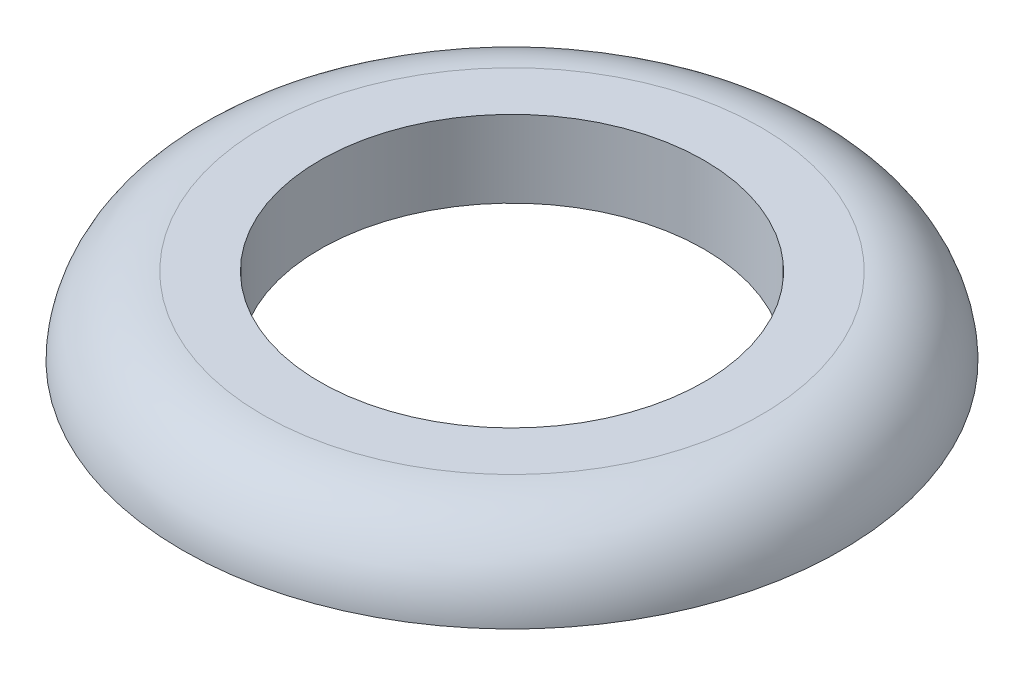
ISO-10303-21;
HEADER;
FILE_DESCRIPTION(('STEP AP214'),'2;1');
FILE_NAME('part.step','',(''),(''),'','','');
FILE_SCHEMA(('AUTOMOTIVE_DESIGN { 1 0 10303 214 1 1 1 1 }'));
ENDSEC;
DATA;
#1=APPLICATION_CONTEXT('core data for automotive mechanical design processes');
#2=APPLICATION_PROTOCOL_DEFINITION('international standard','automotive_design',2000,#1);
#3=PRODUCT_CONTEXT('',#1,'mechanical');
#4=PRODUCT('Part','Part','',(#3));
#5=PRODUCT_RELATED_PRODUCT_CATEGORY('part','',(#4));
#6=PRODUCT_DEFINITION_FORMATION('','',#4);
#7=PRODUCT_DEFINITION_CONTEXT('part definition',#1,'design');
#8=PRODUCT_DEFINITION('design','',#6,#7);
#9=PRODUCT_DEFINITION_SHAPE('','',#8);
#10=(LENGTH_UNIT() NAMED_UNIT(*) SI_UNIT(.MILLI.,.METRE.));
#11=(NAMED_UNIT(*) PLANE_ANGLE_UNIT() SI_UNIT($,.RADIAN.));
#12=(NAMED_UNIT(*) SI_UNIT($,.STERADIAN.) SOLID_ANGLE_UNIT());
#13=UNCERTAINTY_MEASURE_WITH_UNIT(LENGTH_MEASURE(1.E-05),#10,'distance_accuracy_value','');
#14=(GEOMETRIC_REPRESENTATION_CONTEXT(3) GLOBAL_UNCERTAINTY_ASSIGNED_CONTEXT((#13)) GLOBAL_UNIT_ASSIGNED_CONTEXT((#10,
#11,#12)) REPRESENTATION_CONTEXT('',''));
#15=CARTESIAN_POINT('',(0.,0.,0.));
#16=DIRECTION('',(0.,0.,1.));
#17=DIRECTION('',(1.,0.,0.));
#18=AXIS2_PLACEMENT_3D('',#15,#16,#17);
#19=CARTESIAN_POINT('',(0.,11.280775,-5.22552083333418));
#20=DIRECTION('',(0.,1.,0.));
#21=DIRECTION('',(0.,0.,1.));
#22=AXIS2_PLACEMENT_3D('',#19,#20,#21);
#23=PLANE('',#22);
#24=CARTESIAN_POINT('',(0.,11.280775,0.));
#25=DIRECTION('',(0.,-1.,0.));
#26=DIRECTION('',(0.,0.,-1.));
#27=AXIS2_PLACEMENT_3D('',#24,#25,#26);
#28=CIRCLE('',#27,4.0291118051334);
#29=CARTESIAN_POINT('',(0.,11.280775,-4.0291118051334));
#30=VERTEX_POINT('',#29);
#31=EDGE_CURVE('E44',#30,#30,#28,.T.);
#32=ORIENTED_EDGE('',*,*,#31,.T.);
#33=EDGE_LOOP('',(#32));
#34=FACE_BOUND('',#33,.T.);
#35=CARTESIAN_POINT('',(0.,11.2807750000008,0.));
#36=DIRECTION('',(0.,-1.,0.));
#37=DIRECTION('',(0.,0.,1.));
#38=AXIS2_PLACEMENT_3D('',#35,#36,#37);
#39=CIRCLE('',#38,5.22552083333418);
#40=CARTESIAN_POINT('',(0.,11.2807750000005,5.22552083333418));
#41=VERTEX_POINT('',#40);
#42=CARTESIAN_POINT('',(0.,11.2807750000005,-5.22552083333418));
#43=VERTEX_POINT('',#42);
#44=EDGE_CURVE('E34',#41,#43,#39,.T.);
#45=ORIENTED_EDGE('',*,*,#44,.F.);
#46=CARTESIAN_POINT('',(0.,11.2807750000008,0.));
#47=DIRECTION('',(0.,-1.,0.));
#48=DIRECTION('',(0.,0.,-1.));
#49=AXIS2_PLACEMENT_3D('',#46,#47,#48);
#50=CIRCLE('',#49,5.22552083333418);
#51=EDGE_CURVE('E38',#43,#41,#50,.T.);
#52=ORIENTED_EDGE('',*,*,#51,.F.);
#53=EDGE_LOOP('',(#45,#52));
#54=FACE_BOUND('',#53,.T.);
#55=ADVANCED_FACE('F17',(#34,#54),#23,.T.);
#56=CARTESIAN_POINT('',(0.,9.59114583333418,0.));
#57=DIRECTION('',(0.,-1.,0.));
#58=DIRECTION('',(0.,0.,-1.));
#59=AXIS2_PLACEMENT_3D('',#56,#57,#58);
#60=TOROIDAL_SURFACE('',#59,5.22552083333418,1.68962916666658);
#61=CARTESIAN_POINT('',(0.,9.66734583333418,0.));
#62=DIRECTION('',(0.,-1.,0.));
#63=DIRECTION('',(0.,0.,-1.));
#64=AXIS2_PLACEMENT_3D('',#61,#62,#63);
#65=CIRCLE('',#64,6.91343086673359);
#66=CARTESIAN_POINT('',(0.,9.66734583333418,-6.91343086673359));
#67=VERTEX_POINT('',#66);
#68=EDGE_CURVE('E28',#67,#67,#65,.T.);
#69=ORIENTED_EDGE('',*,*,#68,.F.);
#70=EDGE_LOOP('',(#69));
#71=FACE_BOUND('',#70,.T.);
#72=ORIENTED_EDGE('',*,*,#51,.T.);
#73=ORIENTED_EDGE('',*,*,#44,.T.);
#74=EDGE_LOOP('',(#72,#73));
#75=FACE_BOUND('',#74,.T.);
#76=ADVANCED_FACE('F43',(#71,#75),#60,.T.);
#77=CARTESIAN_POINT('',(0.,9.66734583333418,0.));
#78=DIRECTION('',(0.,-1.,0.));
#79=DIRECTION('',(0.,0.,-1.));
#80=AXIS2_PLACEMENT_3D('',#77,#78,#79);
#81=CYLINDRICAL_SURFACE('',#80,4.0291118051334);
#82=CARTESIAN_POINT('',(0.,9.66734583333418,0.));
#83=DIRECTION('',(0.,-1.,0.));
#84=DIRECTION('',(0.,0.,-1.));
#85=AXIS2_PLACEMENT_3D('',#82,#83,#84);
#86=CIRCLE('',#85,4.0291118051334);
#87=CARTESIAN_POINT('',(0.,9.66734583333418,-4.0291118051334));
#88=VERTEX_POINT('',#87);
#89=EDGE_CURVE('E11',#88,#88,#86,.F.);
#90=ORIENTED_EDGE('',*,*,#89,.F.);
#91=EDGE_LOOP('',(#90));
#92=FACE_BOUND('',#91,.T.);
#93=ORIENTED_EDGE('',*,*,#31,.F.);
#94=EDGE_LOOP('',(#93));
#95=FACE_BOUND('',#94,.T.);
#96=ADVANCED_FACE('F60',(#92,#95),#81,.F.);
#97=CARTESIAN_POINT('',(0.,9.66734583333418,-4.0291118051334));
#98=DIRECTION('',(0.,-1.,0.));
#99=DIRECTION('',(0.,0.,-1.));
#100=AXIS2_PLACEMENT_3D('',#97,#98,#99);
#101=PLANE('',#100);
#102=ORIENTED_EDGE('',*,*,#89,.T.);
#103=EDGE_LOOP('',(#102));
#104=FACE_BOUND('',#103,.T.);
#105=ORIENTED_EDGE('',*,*,#68,.T.);
#106=EDGE_LOOP('',(#105));
#107=FACE_BOUND('',#106,.T.);
#108=ADVANCED_FACE('F66',(#104,#107),#101,.T.);
#109=CLOSED_SHELL('',(#55,#76,#96,#108));
#110=MANIFOLD_SOLID_BREP('B1',#109);
#111=ADVANCED_BREP_SHAPE_REPRESENTATION('',(#18,#110),#14);
#112=SHAPE_DEFINITION_REPRESENTATION(#9,#111);
ENDSEC;
END-ISO-10303-21;
